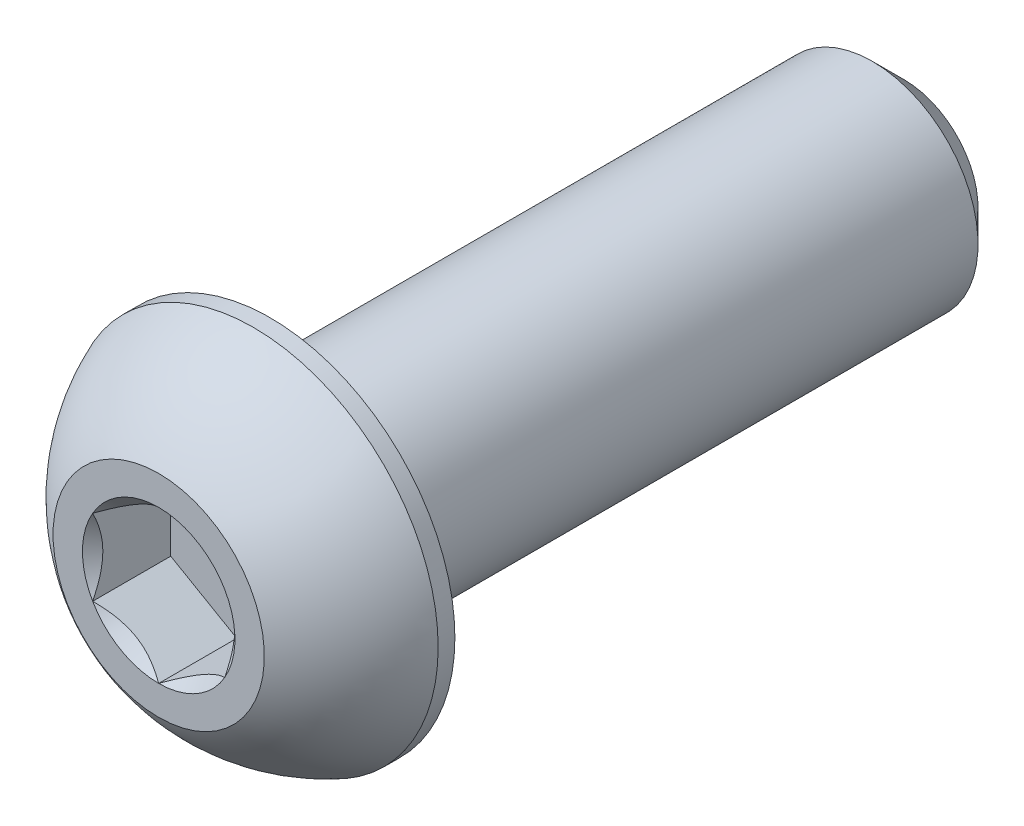
ISO-10303-21;
HEADER;
FILE_DESCRIPTION(('STEP AP214'),'2;1');
FILE_NAME('part.step','',(''),(''),'','','');
FILE_SCHEMA(('AUTOMOTIVE_DESIGN { 1 0 10303 214 1 1 1 1 }'));
ENDSEC;
DATA;
#1=APPLICATION_CONTEXT('core data for automotive mechanical design processes');
#2=APPLICATION_PROTOCOL_DEFINITION('international standard','automotive_design',2000,#1);
#3=PRODUCT_CONTEXT('',#1,'mechanical');
#4=PRODUCT('Part','Part','',(#3));
#5=PRODUCT_RELATED_PRODUCT_CATEGORY('part','',(#4));
#6=PRODUCT_DEFINITION_FORMATION('','',#4);
#7=PRODUCT_DEFINITION_CONTEXT('part definition',#1,'design');
#8=PRODUCT_DEFINITION('design','',#6,#7);
#9=PRODUCT_DEFINITION_SHAPE('','',#8);
#10=(LENGTH_UNIT() NAMED_UNIT(*) SI_UNIT(.MILLI.,.METRE.));
#11=(NAMED_UNIT(*) PLANE_ANGLE_UNIT() SI_UNIT($,.RADIAN.));
#12=(NAMED_UNIT(*) SI_UNIT($,.STERADIAN.) SOLID_ANGLE_UNIT());
#13=UNCERTAINTY_MEASURE_WITH_UNIT(LENGTH_MEASURE(1.E-05),#10,'distance_accuracy_value','');
#14=(GEOMETRIC_REPRESENTATION_CONTEXT(3) GLOBAL_UNCERTAINTY_ASSIGNED_CONTEXT((#13)) GLOBAL_UNIT_ASSIGNED_CONTEXT((#10,
#11,#12)) REPRESENTATION_CONTEXT('',''));
#15=CARTESIAN_POINT('',(0.,0.,0.));
#16=DIRECTION('',(0.,0.,1.));
#17=DIRECTION('',(1.,0.,0.));
#18=AXIS2_PLACEMENT_3D('',#15,#16,#17);
#19=CARTESIAN_POINT('',(0.,-3.175,-22.4028));
#20=DIRECTION('',(0.,0.,-1.));
#21=DIRECTION('',(0.,1.,0.));
#22=AXIS2_PLACEMENT_3D('',#19,#20,#21);
#23=PLANE('',#22);
#24=CARTESIAN_POINT('',(0.,0.,-22.4028));
#25=DIRECTION('',(0.,0.,-1.));
#26=DIRECTION('',(0.,1.,0.));
#27=AXIS2_PLACEMENT_3D('',#24,#25,#26);
#28=CIRCLE('',#27,2.22250000000001);
#29=CARTESIAN_POINT('',(0.,2.22250000000001,-22.4028));
#30=VERTEX_POINT('',#29);
#31=EDGE_CURVE('E176',#30,#30,#28,.T.);
#32=ORIENTED_EDGE('',*,*,#31,.T.);
#33=EDGE_LOOP('',(#32));
#34=FACE_BOUND('',#33,.T.);
#35=ADVANCED_FACE('F36',(#34),#23,.T.);
#36=CARTESIAN_POINT('',(0.,0.,-22.4028));
#37=DIRECTION('',(0.,0.,-1.));
#38=DIRECTION('',(0.,1.,0.));
#39=AXIS2_PLACEMENT_3D('',#36,#37,#38);
#40=CYLINDRICAL_SURFACE('',#39,3.175);
#41=CARTESIAN_POINT('',(0.,0.,-21.4503));
#42=DIRECTION('',(0.,0.,-1.));
#43=DIRECTION('',(0.,1.,0.));
#44=AXIS2_PLACEMENT_3D('',#41,#42,#43);
#45=CIRCLE('',#44,3.175);
#46=CARTESIAN_POINT('',(0.,3.175,-21.4503));
#47=VERTEX_POINT('',#46);
#48=EDGE_CURVE('E50',#47,#47,#45,.F.);
#49=ORIENTED_EDGE('',*,*,#48,.T.);
#50=EDGE_LOOP('',(#49));
#51=FACE_BOUND('',#50,.T.);
#52=CARTESIAN_POINT('',(0.,0.,-3.3528));
#53=DIRECTION('',(0.,0.,1.));
#54=DIRECTION('',(1.,0.,0.));
#55=AXIS2_PLACEMENT_3D('',#52,#53,#54);
#56=CIRCLE('',#55,3.175);
#57=CARTESIAN_POINT('',(3.175,0.,-3.3528));
#58=VERTEX_POINT('',#57);
#59=EDGE_CURVE('E173',#58,#58,#56,.F.);
#60=ORIENTED_EDGE('',*,*,#59,.T.);
#61=EDGE_LOOP('',(#60));
#62=FACE_BOUND('',#61,.T.);
#63=ADVANCED_FACE('F181',(#51,#62),#40,.T.);
#64=CARTESIAN_POINT('',(0.,0.,-22.4028));
#65=DIRECTION('',(0.,0.,1.));
#66=DIRECTION('',(0.,-1.,0.));
#67=AXIS2_PLACEMENT_3D('',#64,#65,#66);
#68=CONICAL_SURFACE('',#67,2.22250000000001,0.785398163397448);
#69=ORIENTED_EDGE('',*,*,#48,.F.);
#70=EDGE_LOOP('',(#69));
#71=FACE_BOUND('',#70,.T.);
#72=ORIENTED_EDGE('',*,*,#31,.F.);
#73=EDGE_LOOP('',(#72));
#74=FACE_BOUND('',#73,.T.);
#75=ADVANCED_FACE('F38',(#71,#74),#68,.T.);
#76=CARTESIAN_POINT('',(0.,0.,-5.060315));
#77=DIRECTION('',(0.,0.,1.));
#78=DIRECTION('',(0.,-1.,0.));
#79=AXIS2_PLACEMENT_3D('',#76,#77,#78);
#80=SPHERICAL_SURFACE('',#79,5.97389428256184);
#81=CARTESIAN_POINT('',(0.,0.,0.));
#82=DIRECTION('',(0.,0.,1.));
#83=DIRECTION('',(1.,0.,0.));
#84=AXIS2_PLACEMENT_3D('',#81,#82,#83);
#85=CIRCLE('',#84,3.175);
#86=CARTESIAN_POINT('',(0.,-3.175,0.));
#87=VERTEX_POINT('',#86);
#88=EDGE_CURVE('E170',#87,#87,#85,.T.);
#89=CARTESIAN_POINT('',(0.,0.,-2.84988));
#90=DIRECTION('',(0.,0.,1.));
#91=DIRECTION('',(1.,0.,0.));
#92=AXIS2_PLACEMENT_3D('',#89,#90,#91);
#93=CIRCLE('',#92,5.5499);
#94=CARTESIAN_POINT('',(0.,-5.5499,-2.84988));
#95=VERTEX_POINT('',#94);
#96=EDGE_CURVE('E164',#95,#95,#93,.T.);
#97=CARTESIAN_POINT('',(0.,-3.175,0.));
#98=CARTESIAN_POINT('',(0.,-3.20828343957184,-0.0208830076580502));
#99=CARTESIAN_POINT('',(0.,-3.24136078860705,-0.0420944789280503));
#100=CARTESIAN_POINT('',(0.,-3.30709055775141,-0.0851658910984718));
#101=CARTESIAN_POINT('',(0.,-3.33974297786056,-0.107025831998893));
#102=CARTESIAN_POINT('',(0.,-3.40461014130008,-0.151385725836676));
#103=CARTESIAN_POINT('',(0.,-3.43682488463043,-0.173885678774039));
#104=CARTESIAN_POINT('',(0.,-3.50080416139461,-0.219516822259479));
#105=CARTESIAN_POINT('',(0.,-3.53256869482844,-0.242648012807557));
#106=CARTESIAN_POINT('',(0.,-3.59563518208834,-0.289532629449102));
#107=CARTESIAN_POINT('',(0.,-3.62693713591442,-0.313286055542569));
#108=CARTESIAN_POINT('',(0.,-3.68906627753106,-0.36140589409133));
#109=CARTESIAN_POINT('',(0.,-3.71989346532163,-0.385772306546626));
#110=CARTESIAN_POINT('',(0.,-3.78106107243204,-0.435108631276877));
#111=CARTESIAN_POINT('',(0.,-3.8114014917519,-0.460078543551833));
#112=CARTESIAN_POINT('',(0.,-3.87158374923259,-0.510612146063938));
#113=CARTESIAN_POINT('',(0.,-3.90142558739343,-0.536175836301086));
#114=CARTESIAN_POINT('',(0.,-3.96059906392414,-0.587887041792083));
#115=CARTESIAN_POINT('',(0.,-3.989930702294,-0.614034557045931));
#116=CARTESIAN_POINT('',(0.,-4.04807235926832,-0.666903232293407));
#117=CARTESIAN_POINT('',(0.,-4.07688237787279,-0.693624392287034));
#118=CARTESIAN_POINT('',(0.,-4.13396957842491,-0.747629953401057));
#119=CARTESIAN_POINT('',(0.,-4.16224676037257,-0.774914354521453));
#120=CARTESIAN_POINT('',(0.,-4.21825727817542,-0.830035774981947));
#121=CARTESIAN_POINT('',(0.,-4.24599061403061,-0.857872794322045));
#122=CARTESIAN_POINT('',(0.,-4.30090264195357,-0.91408861315902));
#123=CARTESIAN_POINT('',(0.,-4.32808133402134,-0.942467412655899));
#124=CARTESIAN_POINT('',(0.,-4.38187349261953,-0.999755742806741));
#125=CARTESIAN_POINT('',(0.,-4.40848695914995,-1.0286652734607));
#126=CARTESIAN_POINT('',(0.,-4.46113830498838,-1.08700381029123));
#127=CARTESIAN_POINT('',(0.,-4.48717618429639,-1.11643281646778));
#128=CARTESIAN_POINT('',(0.,-4.53866621810402,-1.17579884645643));
#129=CARTESIAN_POINT('',(0.,-4.56411837260364,-1.20573587026853));
#130=CARTESIAN_POINT('',(0.,-4.61442704725457,-1.26610627984964));
#131=CARTESIAN_POINT('',(0.,-4.63928356740587,-1.29653966561866));
#132=CARTESIAN_POINT('',(0.,-4.68839129572448,-1.3578909501815));
#133=CARTESIAN_POINT('',(0.,-4.71264250389178,-1.38880884897531));
#134=CARTESIAN_POINT('',(0.,-4.76053016627881,-1.45111712201534));
#135=CARTESIAN_POINT('',(0.,-4.78416662049853,-1.48250749626155));
#136=CARTESIAN_POINT('',(0.,-4.8308155723751,-1.54574849868041));
#137=CARTESIAN_POINT('',(0.,-4.85382807003194,-1.57759912685306));
#138=CARTESIAN_POINT('',(0.,-4.89922014909859,-1.64174823640362));
#139=CARTESIAN_POINT('',(0.,-4.92159973050841,-1.67404671778154));
#140=CARTESIAN_POINT('',(0.,-4.96571726381658,-1.73907895865427));
#141=CARTESIAN_POINT('',(0.,-4.98745521571493,-1.77181271814908));
#142=CARTESIAN_POINT('',(0.,-5.03028102654719,-1.83770277069632));
#143=CARTESIAN_POINT('',(0.,-5.0513688854811,-1.87085906374874));
#144=CARTESIAN_POINT('',(0.,-5.09288630004063,-1.93758127434189));
#145=CARTESIAN_POINT('',(0.,-5.11331585566624,-1.97114719188261));
#146=CARTESIAN_POINT('',(0.,-5.15350870956168,-2.03867558290299));
#147=CARTESIAN_POINT('',(0.,-5.17327200783151,-2.07263805638265));
#148=CARTESIAN_POINT('',(0.,-5.21212465239608,-2.14094633632486));
#149=CARTESIAN_POINT('',(0.,-5.23121399869082,-2.17529214278741));
#150=CARTESIAN_POINT('',(0.,-5.26871130697935,-2.2443537165359));
#151=CARTESIAN_POINT('',(0.,-5.28711926897315,-2.27906948382184));
#152=CARTESIAN_POINT('',(0.,-5.32324664200827,-2.3488574628552));
#153=CARTESIAN_POINT('',(0.,-5.3409660530496,-2.38392967460262));
#154=CARTESIAN_POINT('',(0.,-5.37570942417474,-2.45441688802313));
#155=CARTESIAN_POINT('',(0.,-5.39273338425856,-2.48983188969622));
#156=CARTESIAN_POINT('',(0.,-5.42607922958184,-2.56099089271574));
#157=CARTESIAN_POINT('',(0.,-5.44240111482132,-2.59673489406217));
#158=CARTESIAN_POINT('',(0.,-5.47433643994316,-2.66853798649801));
#159=CARTESIAN_POINT('',(0.,-5.48994987982553,-2.70459707758742));
#160=CARTESIAN_POINT('',(0.,-5.52046229408188,-2.77701628549785));
#161=CARTESIAN_POINT('',(0.,-5.53536126845586,-2.81337640231887));
#162=CARTESIAN_POINT('',(0.,-5.5499,-2.84988));
#163=B_SPLINE_CURVE_WITH_KNOTS('',3,(#97,#98,#99,#100,#101,#102,#103,#104,#105,#106,#107,#108,
#109,#110,#111,#112,#113,#114,#115,#116,#117,#118,#119,#120,#121,#122,#123,#124,#125,#126,#127,
#128,#129,#130,#131,#132,#133,#134,#135,#136,#137,#138,#139,#140,#141,#142,#143,#144,#145,#146,
#147,#148,#149,#150,#151,#152,#153,#154,#155,#156,#157,#158,#159,#160,#161,#162),.UNSPECIFIED.,
.F.,.F.,(4,2,2,2,2,2,2,2,2,2,2,2,2,2,2,2,2,2,2,2,2,2,2,2,2,2,2,2,2,2,2,2,4),(0.,0.1178750807537,
0.235750161507399,0.353625242261099,0.471500323014798,0.589375403768498,0.707250484522198,
0.825125565275897,0.943000646029597,1.0608757267833,1.17875080753699,1.2966258882907,
1.41450096904439,1.53237604979809,1.65025113055179,1.76812621130549,1.88600129205919,
2.00387637281289,2.12175145356659,2.23962653432029,2.35750161507399,2.47537669582769,
2.59325177658139,2.71112685733509,2.82900193808879,2.94687701884249,3.06475209959619,
3.18262718034989,3.30050226110359,3.41837734185729,3.53625242261099,3.65412750336469,
3.77200258411839),.UNSPECIFIED.);
#164=EDGE_CURVE('BSEAM186',#87,#95,#163,.T.);
#165=ORIENTED_EDGE('',*,*,#88,.F.);
#166=ORIENTED_EDGE('',*,*,#96,.T.);
#167=ORIENTED_EDGE('',*,*,#164,.T.);
#168=ORIENTED_EDGE('',*,*,#164,.F.);
#169=EDGE_LOOP('',(#165,#167,#166,#168));
#170=FACE_BOUND('',#169,.T.);
#171=ADVANCED_FACE('F186',(#170),#80,.T.);
#172=CARTESIAN_POINT('',(0.,-3.175,0.));
#173=DIRECTION('',(0.,0.,-1.));
#174=DIRECTION('',(-1.,0.,0.));
#175=AXIS2_PLACEMENT_3D('',#172,#173,#174);
#176=PLANE('',#175);
#177=CARTESIAN_POINT('',(0.,0.,0.));
#178=DIRECTION('',(0.,0.,1.));
#179=DIRECTION('',(1.,0.,0.));
#180=AXIS2_PLACEMENT_3D('',#177,#178,#179);
#181=CIRCLE('',#180,2.29135888084633);
#182=CARTESIAN_POINT('',(-1.984375,1.14567944042316,0.));
#183=VERTEX_POINT('',#182);
#184=CARTESIAN_POINT('',(-1.984375,-1.14567944042316,0.));
#185=VERTEX_POINT('',#184);
#186=EDGE_CURVE('E63',#183,#185,#181,.T.);
#187=ORIENTED_EDGE('',*,*,#186,.F.);
#188=CARTESIAN_POINT('',(0.,2.29135888084633,0.));
#189=VERTEX_POINT('',#188);
#190=EDGE_CURVE('E135',#189,#183,#181,.T.);
#191=ORIENTED_EDGE('',*,*,#190,.F.);
#192=CARTESIAN_POINT('',(1.984375,1.14567944042316,0.));
#193=VERTEX_POINT('',#192);
#194=EDGE_CURVE('E132',#193,#189,#181,.T.);
#195=ORIENTED_EDGE('',*,*,#194,.F.);
#196=CARTESIAN_POINT('',(1.984375,-1.14567944042316,0.));
#197=VERTEX_POINT('',#196);
#198=EDGE_CURVE('E103',#197,#193,#181,.T.);
#199=ORIENTED_EDGE('',*,*,#198,.F.);
#200=CARTESIAN_POINT('',(0.,-2.29135888084633,0.));
#201=VERTEX_POINT('',#200);
#202=EDGE_CURVE('E95',#201,#197,#181,.T.);
#203=ORIENTED_EDGE('',*,*,#202,.F.);
#204=EDGE_CURVE('E56',#185,#201,#181,.T.);
#205=ORIENTED_EDGE('',*,*,#204,.F.);
#206=EDGE_LOOP('',(#187,#191,#195,#199,#203,#205));
#207=FACE_BOUND('',#206,.T.);
#208=ORIENTED_EDGE('',*,*,#88,.T.);
#209=EDGE_LOOP('',(#208));
#210=FACE_BOUND('',#209,.T.);
#211=ADVANCED_FACE('F129',(#207,#210),#176,.F.);
#212=CARTESIAN_POINT('',(0.,-5.5499,-3.3528));
#213=DIRECTION('',(0.,0.,1.));
#214=DIRECTION('',(1.,0.,0.));
#215=AXIS2_PLACEMENT_3D('',#212,#213,#214);
#216=PLANE('',#215);
#217=ORIENTED_EDGE('',*,*,#59,.F.);
#218=EDGE_LOOP('',(#217));
#219=FACE_BOUND('',#218,.T.);
#220=CARTESIAN_POINT('',(0.,0.,-3.3528));
#221=DIRECTION('',(0.,0.,1.));
#222=DIRECTION('',(1.,0.,0.));
#223=AXIS2_PLACEMENT_3D('',#220,#221,#222);
#224=CIRCLE('',#223,5.5499);
#225=CARTESIAN_POINT('',(5.5499,0.,-3.3528));
#226=VERTEX_POINT('',#225);
#227=EDGE_CURVE('E167',#226,#226,#224,.T.);
#228=ORIENTED_EDGE('',*,*,#227,.F.);
#229=EDGE_LOOP('',(#228));
#230=FACE_BOUND('',#229,.T.);
#231=ADVANCED_FACE('F200',(#219,#230),#216,.F.);
#232=CARTESIAN_POINT('',(0.,0.,0.));
#233=DIRECTION('',(0.,0.,1.));
#234=DIRECTION('',(1.,0.,0.));
#235=AXIS2_PLACEMENT_3D('',#232,#233,#234);
#236=CYLINDRICAL_SURFACE('',#235,5.5499);
#237=ORIENTED_EDGE('',*,*,#96,.F.);
#238=EDGE_LOOP('',(#237));
#239=FACE_BOUND('',#238,.T.);
#240=ORIENTED_EDGE('',*,*,#227,.T.);
#241=EDGE_LOOP('',(#240));
#242=FACE_BOUND('',#241,.T.);
#243=ADVANCED_FACE('F203',(#239,#242),#236,.T.);
#244=CARTESIAN_POINT('',(0.,0.,0.));
#245=DIRECTION('',(0.,0.,1.));
#246=DIRECTION('',(1.,0.,0.));
#247=AXIS2_PLACEMENT_3D('',#244,#245,#246);
#248=CONICAL_SURFACE('',#247,2.29135888084633,0.78539816339745);
#249=ORIENTED_EDGE('',*,*,#198,.T.);
#250=CARTESIAN_POINT('',(1.984375,-2.28495242157822,0.734984078816568));
#251=CARTESIAN_POINT('',(1.984375,-2.22931635455402,0.692986685550762));
#252=CARTESIAN_POINT('',(1.984375,-2.17336876548389,0.651396054076336));
#253=CARTESIAN_POINT('',(1.984375,-2.06072770258171,0.569208461471479));
#254=CARTESIAN_POINT('',(1.984375,-2.00403404503435,0.528611752405042));
#255=CARTESIAN_POINT('',(1.984375,-1.88936329173488,0.448303503174668));
#256=CARTESIAN_POINT('',(1.984375,-1.83137965519348,0.408601258813307));
#257=CARTESIAN_POINT('',(1.984375,-1.7144280213784,0.330685173401292));
#258=CARTESIAN_POINT('',(1.984375,-1.65546009407228,0.292471227194368));
#259=CARTESIAN_POINT('',(1.984375,-1.47005472306035,0.176252834013637));
#260=CARTESIAN_POINT('',(1.984375,-1.34163909427883,0.101347886872381));
#261=CARTESIAN_POINT('',(1.984375,-1.0784038470548,-0.0356697845602627));
#262=CARTESIAN_POINT('',(1.984375,-0.943607781407424,-0.0978256335176254));
#263=CARTESIAN_POINT('',(1.984375,-0.741275100444881,-0.173867421311381));
#264=CARTESIAN_POINT('',(1.984375,-0.676735408881095,-0.195691938673995));
#265=CARTESIAN_POINT('',(1.984375,-0.546098118112761,-0.234159536462205));
#266=CARTESIAN_POINT('',(1.984375,-0.480000411919955,-0.250802259934452));
#267=CARTESIAN_POINT('',(1.984375,-0.347746170028531,-0.277764619130277));
#268=CARTESIAN_POINT('',(1.984375,-0.281612071479122,-0.288192590264109));
#269=CARTESIAN_POINT('',(1.984375,-0.14863662005235,-0.302521852623404));
#270=CARTESIAN_POINT('',(1.984375,-0.0817953907393235,-0.306424265772614));
#271=CARTESIAN_POINT('',(1.984375,0.0495156750890644,-0.307412948667327));
#272=CARTESIAN_POINT('',(1.984375,0.113983775102991,-0.304740821124985));
#273=CARTESIAN_POINT('',(1.984375,0.242367515846177,-0.293260789502485));
#274=CARTESIAN_POINT('',(1.984375,0.30628310229592,-0.284452289360786));
#275=CARTESIAN_POINT('',(1.984375,0.434181040262184,-0.261030978667103));
#276=CARTESIAN_POINT('',(1.984375,0.498145026858309,-0.246319393767914));
#277=CARTESIAN_POINT('',(1.984375,0.624675616953007,-0.211873818587874));
#278=CARTESIAN_POINT('',(1.984375,0.687242336899689,-0.192140248550805));
#279=CARTESIAN_POINT('',(1.984375,0.884225483826088,-0.12258776276924));
#280=CARTESIAN_POINT('',(1.984375,1.01583674256468,-0.0648475887435034));
#281=CARTESIAN_POINT('',(1.984375,1.27288659242652,0.063530336588798));
#282=CARTESIAN_POINT('',(1.984375,1.3983008827048,0.134214424919413));
#283=CARTESIAN_POINT('',(1.984375,1.57956687990221,0.244516663813199));
#284=CARTESIAN_POINT('',(1.984375,1.63738271299424,0.280969829475364));
#285=CARTESIAN_POINT('',(1.984375,1.75202215386202,0.355415963291705));
#286=CARTESIAN_POINT('',(1.984375,1.80884568601362,0.393409048078054));
#287=CARTESIAN_POINT('',(1.984375,1.92116923084255,0.470338808893091));
#288=CARTESIAN_POINT('',(1.984375,1.97667624512253,0.509265313038791));
#289=CARTESIAN_POINT('',(1.984375,2.08693170717166,0.588147746121386));
#290=CARTESIAN_POINT('',(1.984375,2.14168035934793,0.62810338902403));
#291=CARTESIAN_POINT('',(1.984375,2.19611149046622,0.668480611285427));
#292=B_SPLINE_CURVE_WITH_KNOTS('',3,(#250,#251,#252,#253,#254,#255,#256,#257,#258,#259,#260,
#261,#262,#263,#264,#265,#266,#267,#268,#269,#270,#271,#272,#273,#274,#275,#276,#277,#278,#279,
#280,#281,#282,#283,#284,#285,#286,#287,#288,#289,#290,#291),.UNSPECIFIED.,.F.,.F.,(4,2,2,2,2,2,
2,2,2,2,2,2,2,2,2,2,2,2,2,2,4),(0.,0.209126070008322,0.418304637356569,0.629103979977992,
0.839888401371185,1.28549951116127,1.72957750768351,1.93379389749971,2.13802435186698,
2.33858179514334,2.53910475350639,2.73236963400794,2.92565329006887,3.12231577097487,
3.31896180041345,3.74886295245172,4.18033428125362,4.3853601718029,4.59040161996383,
4.79377749165108,4.99709743524131),.UNSPECIFIED.);
#293=EDGE_CURVE('E11',#197,#193,#292,.T.);
#294=ORIENTED_EDGE('',*,*,#293,.F.);
#295=EDGE_LOOP('',(#249,#294));
#296=FACE_BOUND('',#295,.T.);
#297=ADVANCED_FACE('F107',(#296),#248,.F.);
#298=ORIENTED_EDGE('',*,*,#194,.T.);
#299=CARTESIAN_POINT('',(1.984575,1.14556397036933,0.000115478781843379));
#300=CARTESIAN_POINT('',(1.9163590048332,1.18494849354192,-0.0392371477360855));
#301=CARTESIAN_POINT('',(1.84700231489303,1.22499159714897,-0.0762786895538155));
#302=CARTESIAN_POINT('',(1.70557619954781,1.30664400291398,-0.144101141576677));
#303=CARTESIAN_POINT('',(1.63349332126322,1.34826107209555,-0.174844310908246));
#304=CARTESIAN_POINT('',(1.488141602734,1.43217992591557,-0.227508111188786));
#305=CARTESIAN_POINT('',(1.41490978751306,1.47446033414663,-0.249561124120036));
#306=CARTESIAN_POINT('',(1.26683381740529,1.55995203534886,-0.283538507056124));
#307=CARTESIAN_POINT('',(1.19199418724658,1.60316071596705,-0.295488243908271));
#308=CARTESIAN_POINT('',(1.06301458545618,1.6776271237807,-0.306269900918094));
#309=CARTESIAN_POINT('',(1.00904128422756,1.7087886237741,-0.30786610094093));
#310=CARTESIAN_POINT('',(0.901182881480199,1.77106070163465,-0.305178161134708));
#311=CARTESIAN_POINT('',(0.847297817514476,1.80217125782056,-0.300891959659541));
#312=CARTESIAN_POINT('',(0.740036461751395,1.86409863044402,-0.286683126986481));
#313=CARTESIAN_POINT('',(0.686660807239859,1.89491507894443,-0.276754189547727));
#314=CARTESIAN_POINT('',(0.580832482591103,1.95601509066828,-0.251804915725461));
#315=CARTESIAN_POINT('',(0.528379742028898,1.9862986945516,-0.236784969610512));
#316=CARTESIAN_POINT('',(0.394017661036351,2.06387267818152,-0.19219214836433));
#317=CARTESIAN_POINT('',(0.312941642841675,2.11068193911104,-0.159257004061667));
#318=CARTESIAN_POINT('',(0.19372669327016,2.17951072233758,-0.103657558797803));
#319=CARTESIAN_POINT('',(0.154440075613998,2.20219286161692,-0.0841224079481375));
#320=CARTESIAN_POINT('',(0.0765946381319467,2.24713694590237,-0.0432712618805984));
#321=CARTESIAN_POINT('',(0.0380353888983008,2.26939913882716,-0.0219563604316496));
#322=CARTESIAN_POINT('',(-0.00020000000000058,2.29147435090017,0.000115478781842942));
#323=B_SPLINE_CURVE_WITH_KNOTS('',3,(#299,#300,#301,#302,#303,#304,#305,#306,#307,#308,#309,
#310,#311,#312,#313,#314,#315,#316,#317,#318,#319,#320,#321,#322),.UNSPECIFIED.,.F.,.F.,(4,2,2,
2,2,2,2,2,2,2,2,4),(0.,0.264339630306627,0.530219665093694,0.79187641637146,1.05287424418109,
1.239639843932,1.42647091743852,1.61351120244035,1.8005371524754,2.09764209964316,
2.24579179873714,2.39385111134157),.UNSPECIFIED.);
#324=EDGE_CURVE('E134',#193,#189,#323,.T.);
#325=ORIENTED_EDGE('',*,*,#324,.F.);
#326=EDGE_LOOP('',(#298,#325));
#327=FACE_BOUND('',#326,.T.);
#328=ADVANCED_FACE('F288',(#327),#248,.F.);
#329=ORIENTED_EDGE('',*,*,#190,.T.);
#330=CARTESIAN_POINT('',(0.000199999999999608,2.29147435090017,0.000115478781843248));
#331=CARTESIAN_POINT('',(-0.0680159951668025,2.25208982772757,-0.0392371477360854));
#332=CARTESIAN_POINT('',(-0.137372685106966,2.21204672412052,-0.0762786895538155));
#333=CARTESIAN_POINT('',(-0.278798800452188,2.13039431835551,-0.144101141576677));
#334=CARTESIAN_POINT('',(-0.350881678736783,2.08877724917394,-0.174844310908246));
#335=CARTESIAN_POINT('',(-0.496233397266004,2.00485839535392,-0.227508111188786));
#336=CARTESIAN_POINT('',(-0.569465212486939,1.96257798712287,-0.249561124120036));
#337=CARTESIAN_POINT('',(-0.717541182594707,1.87708628592063,-0.283538507056124));
#338=CARTESIAN_POINT('',(-0.792380812753425,1.83387760530244,-0.295488243908272));
#339=CARTESIAN_POINT('',(-0.921360414543816,1.75941119748879,-0.306269900918094));
#340=CARTESIAN_POINT('',(-0.975333715772443,1.72824969749539,-0.307866100940931));
#341=CARTESIAN_POINT('',(-1.0831921185198,1.66597761963484,-0.305178161134708));
#342=CARTESIAN_POINT('',(-1.13707718248552,1.63486706344893,-0.300891959659541));
#343=CARTESIAN_POINT('',(-1.2443385382486,1.57293969082547,-0.286683126986481));
#344=CARTESIAN_POINT('',(-1.29771419276014,1.54212324232506,-0.276754189547727));
#345=CARTESIAN_POINT('',(-1.4035425174089,1.48102323060122,-0.251804915725462));
#346=CARTESIAN_POINT('',(-1.4559952579711,1.45073962671789,-0.236784969610512));
#347=CARTESIAN_POINT('',(-1.59035733896365,1.37316564308797,-0.19219214836433));
#348=CARTESIAN_POINT('',(-1.67143335715832,1.32635638215845,-0.159257004061668));
#349=CARTESIAN_POINT('',(-1.79064830672984,1.25752759893191,-0.103657558797804));
#350=CARTESIAN_POINT('',(-1.829934924386,1.23484545965257,-0.0841224079481378));
#351=CARTESIAN_POINT('',(-1.90778036186805,1.18990137536712,-0.0432712618805986));
#352=CARTESIAN_POINT('',(-1.9463396111017,1.16763918244233,-0.0219563604316498));
#353=CARTESIAN_POINT('',(-1.984575,1.14556397036933,0.000115478781842511));
#354=B_SPLINE_CURVE_WITH_KNOTS('',3,(#330,#331,#332,#333,#334,#335,#336,#337,#338,#339,#340,
#341,#342,#343,#344,#345,#346,#347,#348,#349,#350,#351,#352,#353),.UNSPECIFIED.,.F.,.F.,(4,2,2,
2,2,2,2,2,2,2,2,4),(0.,0.264339630306627,0.530219665093694,0.791876416371461,1.05287424418109,
1.239639843932,1.42647091743852,1.61351120244035,1.8005371524754,2.09764209964316,
2.24579179873714,2.39385111134157),.UNSPECIFIED.);
#355=EDGE_CURVE('E139',#189,#183,#354,.T.);
#356=ORIENTED_EDGE('',*,*,#355,.F.);
#357=EDGE_LOOP('',(#329,#356));
#358=FACE_BOUND('',#357,.T.);
#359=ADVANCED_FACE('F142',(#358),#248,.F.);
#360=ORIENTED_EDGE('',*,*,#186,.T.);
#361=CARTESIAN_POINT('',(-1.984375,-2.28495242157823,0.734984078816569));
#362=CARTESIAN_POINT('',(-1.984375,-2.22931635455402,0.692986685550762));
#363=CARTESIAN_POINT('',(-1.984375,-2.17336876548389,0.651396054076336));
#364=CARTESIAN_POINT('',(-1.984375,-2.06072770258171,0.56920846147148));
#365=CARTESIAN_POINT('',(-1.984375,-2.00403404503435,0.528611752405043));
#366=CARTESIAN_POINT('',(-1.984375,-1.88936329173489,0.448303503174669));
#367=CARTESIAN_POINT('',(-1.984375,-1.83137965519348,0.408601258813308));
#368=CARTESIAN_POINT('',(-1.984375,-1.7144280213784,0.330685173401292));
#369=CARTESIAN_POINT('',(-1.984375,-1.65546009407228,0.292471227194368));
#370=CARTESIAN_POINT('',(-1.984375,-1.47005472306035,0.176252834013636));
#371=CARTESIAN_POINT('',(-1.984375,-1.34163909427883,0.101347886872382));
#372=CARTESIAN_POINT('',(-1.984375,-1.0784038470548,-0.0356697845602624));
#373=CARTESIAN_POINT('',(-1.984375,-0.943607781407425,-0.0978256335176256));
#374=CARTESIAN_POINT('',(-1.984375,-0.741275100444882,-0.173867421311381));
#375=CARTESIAN_POINT('',(-1.984375,-0.676735408881095,-0.195691938673995));
#376=CARTESIAN_POINT('',(-1.984375,-0.546098118112762,-0.234159536462205));
#377=CARTESIAN_POINT('',(-1.984375,-0.480000411919956,-0.250802259934452));
#378=CARTESIAN_POINT('',(-1.984375,-0.347746170028532,-0.277764619130277));
#379=CARTESIAN_POINT('',(-1.984375,-0.281612071479123,-0.288192590264108));
#380=CARTESIAN_POINT('',(-1.984375,-0.14863662005235,-0.302521852623404));
#381=CARTESIAN_POINT('',(-1.984375,-0.0817953907393237,-0.306424265772614));
#382=CARTESIAN_POINT('',(-1.984375,0.0495156750890643,-0.307412948667328));
#383=CARTESIAN_POINT('',(-1.984375,0.113983775102991,-0.304740821124985));
#384=CARTESIAN_POINT('',(-1.984375,0.242367515846177,-0.293260789502485));
#385=CARTESIAN_POINT('',(-1.984375,0.306283102295919,-0.284452289360786));
#386=CARTESIAN_POINT('',(-1.984375,0.434181040262184,-0.261030978667103));
#387=CARTESIAN_POINT('',(-1.984375,0.498145026858309,-0.246319393767914));
#388=CARTESIAN_POINT('',(-1.984375,0.624675616953007,-0.211873818587874));
#389=CARTESIAN_POINT('',(-1.984375,0.687242336899689,-0.192140248550805));
#390=CARTESIAN_POINT('',(-1.984375,0.884225483826087,-0.12258776276924));
#391=CARTESIAN_POINT('',(-1.984375,1.01583674256468,-0.0648475887435036));
#392=CARTESIAN_POINT('',(-1.984375,1.27288659242652,0.0635303365887976));
#393=CARTESIAN_POINT('',(-1.984375,1.3983008827048,0.134214424919412));
#394=CARTESIAN_POINT('',(-1.984375,1.57956687990221,0.244516663813198));
#395=CARTESIAN_POINT('',(-1.984375,1.63738271299424,0.280969829475363));
#396=CARTESIAN_POINT('',(-1.984375,1.75202215386202,0.355415963291704));
#397=CARTESIAN_POINT('',(-1.984375,1.80884568601362,0.393409048078054));
#398=CARTESIAN_POINT('',(-1.984375,1.92116923084255,0.47033880889309));
#399=CARTESIAN_POINT('',(-1.984375,1.97667624512253,0.509265313038791));
#400=CARTESIAN_POINT('',(-1.984375,2.08693170717166,0.588147746121386));
#401=CARTESIAN_POINT('',(-1.984375,2.14168035934793,0.628103389024029));
#402=CARTESIAN_POINT('',(-1.984375,2.19611149046622,0.668480611285426));
#403=B_SPLINE_CURVE_WITH_KNOTS('',3,(#361,#362,#363,#364,#365,#366,#367,#368,#369,#370,#371,
#372,#373,#374,#375,#376,#377,#378,#379,#380,#381,#382,#383,#384,#385,#386,#387,#388,#389,#390,
#391,#392,#393,#394,#395,#396,#397,#398,#399,#400,#401,#402),.UNSPECIFIED.,.F.,.F.,(4,2,2,2,2,2,
2,2,2,2,2,2,2,2,2,2,2,2,2,2,4),(0.,0.209126070008322,0.41830463735657,0.629103979977993,
0.839888401371186,1.28549951116127,1.72957750768351,1.93379389749972,2.13802435186698,
2.33858179514334,2.53910475350639,2.73236963400794,2.92565329006887,3.12231577097488,
3.31896180041345,3.74886295245172,4.18033428125362,4.3853601718029,4.59040161996383,
4.79377749165108,4.99709743524131),.UNSPECIFIED.);
#404=EDGE_CURVE('E146',#183,#185,#403,.F.);
#405=ORIENTED_EDGE('',*,*,#404,.F.);
#406=EDGE_LOOP('',(#360,#405));
#407=FACE_BOUND('',#406,.T.);
#408=ADVANCED_FACE('F282',(#407),#248,.F.);
#409=ORIENTED_EDGE('',*,*,#204,.T.);
#410=CARTESIAN_POINT('',(-1.984575,-1.14556397036933,0.000115478781843379));
#411=CARTESIAN_POINT('',(-1.9163590048332,-1.18494849354192,-0.0392371477360847));
#412=CARTESIAN_POINT('',(-1.84700231489303,-1.22499159714897,-0.0762786895538149));
#413=CARTESIAN_POINT('',(-1.70557619954781,-1.30664400291398,-0.144101141576677));
#414=CARTESIAN_POINT('',(-1.63349332126322,-1.34826107209555,-0.174844310908247));
#415=CARTESIAN_POINT('',(-1.488141602734,-1.43217992591557,-0.227508111188786));
#416=CARTESIAN_POINT('',(-1.41490978751306,-1.47446033414663,-0.249561124120036));
#417=CARTESIAN_POINT('',(-1.26683381740529,-1.55995203534886,-0.283538507056124));
#418=CARTESIAN_POINT('',(-1.19199418724658,-1.60316071596705,-0.295488243908271));
#419=CARTESIAN_POINT('',(-1.06301458545618,-1.6776271237807,-0.306269900918094));
#420=CARTESIAN_POINT('',(-1.00904128422756,-1.7087886237741,-0.30786610094093));
#421=CARTESIAN_POINT('',(-0.9011828814802,-1.77106070163465,-0.305178161134707));
#422=CARTESIAN_POINT('',(-0.847297817514477,-1.80217125782056,-0.30089195965954));
#423=CARTESIAN_POINT('',(-0.740036461751396,-1.86409863044402,-0.286683126986481));
#424=CARTESIAN_POINT('',(-0.68666080723986,-1.89491507894443,-0.276754189547727));
#425=CARTESIAN_POINT('',(-0.580832482591103,-1.95601509066828,-0.251804915725461));
#426=CARTESIAN_POINT('',(-0.528379742028898,-1.9862986945516,-0.236784969610511));
#427=CARTESIAN_POINT('',(-0.394017661036351,-2.06387267818152,-0.19219214836433));
#428=CARTESIAN_POINT('',(-0.312941642841675,-2.11068193911104,-0.159257004061667));
#429=CARTESIAN_POINT('',(-0.19372669327016,-2.17951072233758,-0.103657558797803));
#430=CARTESIAN_POINT('',(-0.154440075613998,-2.20219286161692,-0.0841224079481371));
#431=CARTESIAN_POINT('',(-0.0765946381319465,-2.24713694590237,-0.0432712618805977));
#432=CARTESIAN_POINT('',(-0.0380353888983009,-2.26939913882716,-0.0219563604316487));
#433=CARTESIAN_POINT('',(0.000200000000000425,-2.29147435090017,0.000115478781843735));
#434=B_SPLINE_CURVE_WITH_KNOTS('',3,(#410,#411,#412,#413,#414,#415,#416,#417,#418,#419,#420,
#421,#422,#423,#424,#425,#426,#427,#428,#429,#430,#431,#432,#433),.UNSPECIFIED.,.F.,.F.,(4,2,2,
2,2,2,2,2,2,2,2,4),(0.,0.264339630306627,0.530219665093694,0.79187641637146,1.05287424418109,
1.239639843932,1.42647091743852,1.61351120244035,1.8005371524754,2.09764209964316,
2.24579179873714,2.39385111134157),.UNSPECIFIED.);
#435=EDGE_CURVE('E119',#185,#201,#434,.T.);
#436=ORIENTED_EDGE('',*,*,#435,.F.);
#437=EDGE_LOOP('',(#409,#436));
#438=FACE_BOUND('',#437,.T.);
#439=ADVANCED_FACE('F230',(#438),#248,.F.);
#440=ORIENTED_EDGE('',*,*,#202,.T.);
#441=CARTESIAN_POINT('',(-0.000199999999999594,-2.29147435090017,0.000115478781843681));
#442=CARTESIAN_POINT('',(0.0680159951668032,-2.25208982772757,-0.0392371477360843));
#443=CARTESIAN_POINT('',(0.137372685106967,-2.21204672412052,-0.0762786895538144));
#444=CARTESIAN_POINT('',(0.278798800452188,-2.13039431835551,-0.144101141576676));
#445=CARTESIAN_POINT('',(0.350881678736783,-2.08877724917394,-0.174844310908246));
#446=CARTESIAN_POINT('',(0.496233397266004,-2.00485839535392,-0.227508111188787));
#447=CARTESIAN_POINT('',(0.569465212486939,-1.96257798712287,-0.249561124120036));
#448=CARTESIAN_POINT('',(0.717541182594707,-1.87708628592063,-0.283538507056124));
#449=CARTESIAN_POINT('',(0.792380812753425,-1.83387760530244,-0.295488243908272));
#450=CARTESIAN_POINT('',(0.921360414543816,-1.75941119748879,-0.306269900918094));
#451=CARTESIAN_POINT('',(0.975333715772443,-1.72824969749539,-0.30786610094093));
#452=CARTESIAN_POINT('',(1.0831921185198,-1.66597761963484,-0.305178161134708));
#453=CARTESIAN_POINT('',(1.13707718248552,-1.63486706344893,-0.300891959659541));
#454=CARTESIAN_POINT('',(1.2443385382486,-1.57293969082547,-0.286683126986481));
#455=CARTESIAN_POINT('',(1.29771419276014,-1.54212324232506,-0.276754189547727));
#456=CARTESIAN_POINT('',(1.4035425174089,-1.48102323060122,-0.251804915725462));
#457=CARTESIAN_POINT('',(1.4559952579711,-1.45073962671789,-0.236784969610512));
#458=CARTESIAN_POINT('',(1.59035733896365,-1.37316564308797,-0.19219214836433));
#459=CARTESIAN_POINT('',(1.67143335715832,-1.32635638215845,-0.159257004061668));
#460=CARTESIAN_POINT('',(1.79064830672984,-1.25752759893191,-0.103657558797804));
#461=CARTESIAN_POINT('',(1.829934924386,-1.23484545965257,-0.0841224079481379));
#462=CARTESIAN_POINT('',(1.90778036186805,-1.18990137536712,-0.0432712618805987));
#463=CARTESIAN_POINT('',(1.9463396111017,-1.16763918244233,-0.0219563604316498));
#464=CARTESIAN_POINT('',(1.984575,-1.14556397036933,0.000115478781842673));
#465=B_SPLINE_CURVE_WITH_KNOTS('',3,(#441,#442,#443,#444,#445,#446,#447,#448,#449,#450,#451,
#452,#453,#454,#455,#456,#457,#458,#459,#460,#461,#462,#463,#464),.UNSPECIFIED.,.F.,.F.,(4,2,2,
2,2,2,2,2,2,2,2,4),(0.,0.264339630306627,0.530219665093695,0.791876416371461,1.05287424418109,
1.239639843932,1.42647091743852,1.61351120244035,1.8005371524754,2.09764209964316,
2.24579179873714,2.39385111134157),.UNSPECIFIED.);
#466=EDGE_CURVE('E99',#201,#197,#465,.T.);
#467=ORIENTED_EDGE('',*,*,#466,.F.);
#468=EDGE_LOOP('',(#440,#467));
#469=FACE_BOUND('',#468,.T.);
#470=ADVANCED_FACE('F97',(#469),#248,.F.);
#471=CARTESIAN_POINT('',(1.984375,-1.14567944042316,-2.34696));
#472=DIRECTION('',(0.,0.,1.));
#473=DIRECTION('',(1.,0.,0.));
#474=AXIS2_PLACEMENT_3D('',#471,#472,#473);
#475=PLANE('',#474);
#476=DIRECTION('',(0.866025403784438,0.5,0.));
#477=VECTOR('',#476,1.);
#478=CARTESIAN_POINT('',(0.,-2.29135888084633,-2.34696));
#479=LINE('',#478,#477);
#480=CARTESIAN_POINT('',(0.,-2.29135888084633,-2.34696));
#481=VERTEX_POINT('',#480);
#482=CARTESIAN_POINT('',(1.984375,-1.14567944042316,-2.34696));
#483=VERTEX_POINT('',#482);
#484=EDGE_CURVE('E118',#481,#483,#479,.T.);
#485=ORIENTED_EDGE('',*,*,#484,.T.);
#486=DIRECTION('',(0.,1.,0.));
#487=VECTOR('',#486,1.);
#488=CARTESIAN_POINT('',(1.984375,-1.14567944042316,-2.34696));
#489=LINE('',#488,#487);
#490=CARTESIAN_POINT('',(1.984375,1.14567944042316,-2.34696));
#491=VERTEX_POINT('',#490);
#492=EDGE_CURVE('E123',#483,#491,#489,.T.);
#493=ORIENTED_EDGE('',*,*,#492,.T.);
#494=DIRECTION('',(-0.866025403784439,0.5,0.));
#495=VECTOR('',#494,1.);
#496=CARTESIAN_POINT('',(1.984375,1.14567944042316,-2.34696));
#497=LINE('',#496,#495);
#498=CARTESIAN_POINT('',(0.,2.29135888084633,-2.34696));
#499=VERTEX_POINT('',#498);
#500=EDGE_CURVE('E272',#491,#499,#497,.T.);
#501=ORIENTED_EDGE('',*,*,#500,.T.);
#502=DIRECTION('',(-0.866025403784438,-0.5,0.));
#503=VECTOR('',#502,1.);
#504=CARTESIAN_POINT('',(0.,2.29135888084633,-2.34696));
#505=LINE('',#504,#503);
#506=CARTESIAN_POINT('',(-1.984375,1.14567944042316,-2.34696));
#507=VERTEX_POINT('',#506);
#508=EDGE_CURVE('E155',#499,#507,#505,.T.);
#509=ORIENTED_EDGE('',*,*,#508,.T.);
#510=DIRECTION('',(0.,-1.,0.));
#511=VECTOR('',#510,1.);
#512=CARTESIAN_POINT('',(-1.984375,1.14567944042316,-2.34696));
#513=LINE('',#512,#511);
#514=CARTESIAN_POINT('',(-1.984375,-1.14567944042316,-2.34696));
#515=VERTEX_POINT('',#514);
#516=EDGE_CURVE('E276',#507,#515,#513,.T.);
#517=ORIENTED_EDGE('',*,*,#516,.T.);
#518=DIRECTION('',(0.866025403784439,-0.5,0.));
#519=VECTOR('',#518,1.);
#520=CARTESIAN_POINT('',(-1.984375,-1.14567944042316,-2.34696));
#521=LINE('',#520,#519);
#522=EDGE_CURVE('E126',#515,#481,#521,.T.);
#523=ORIENTED_EDGE('',*,*,#522,.T.);
#524=EDGE_LOOP('',(#485,#493,#501,#509,#517,#523));
#525=FACE_BOUND('',#524,.T.);
#526=ADVANCED_FACE('F229',(#525),#475,.T.);
#527=CARTESIAN_POINT('',(1.984375,-1.14567944042316,-2.34696));
#528=DIRECTION('',(1.,0.,0.));
#529=DIRECTION('',(0.,0.,-1.));
#530=AXIS2_PLACEMENT_3D('',#527,#528,#529);
#531=PLANE('',#530);
#532=DIRECTION('',(0.,0.,1.));
#533=VECTOR('',#532,1.);
#534=CARTESIAN_POINT('',(1.984375,-1.14567944042316,-2.34696));
#535=LINE('',#534,#533);
#536=EDGE_CURVE('E115',#483,#197,#535,.T.);
#537=ORIENTED_EDGE('',*,*,#536,.T.);
#538=ORIENTED_EDGE('',*,*,#293,.T.);
#539=DIRECTION('',(0.,0.,1.));
#540=VECTOR('',#539,1.);
#541=CARTESIAN_POINT('',(1.984375,1.14567944042316,-2.34696));
#542=LINE('',#541,#540);
#543=EDGE_CURVE('E125',#491,#193,#542,.T.);
#544=ORIENTED_EDGE('',*,*,#543,.F.);
#545=ORIENTED_EDGE('',*,*,#492,.F.);
#546=EDGE_LOOP('',(#537,#538,#544,#545));
#547=FACE_BOUND('',#546,.T.);
#548=ADVANCED_FACE('F121',(#547),#531,.F.);
#549=CARTESIAN_POINT('',(1.984375,1.14567944042316,-2.34696));
#550=DIRECTION('',(0.5,0.866025403784439,0.));
#551=DIRECTION('',(-0.866025403784439,0.5,0.));
#552=AXIS2_PLACEMENT_3D('',#549,#550,#551);
#553=PLANE('',#552);
#554=ORIENTED_EDGE('',*,*,#543,.T.);
#555=ORIENTED_EDGE('',*,*,#324,.T.);
#556=DIRECTION('',(0.,0.,1.));
#557=VECTOR('',#556,1.);
#558=CARTESIAN_POINT('',(0.,2.29135888084633,-2.34696));
#559=LINE('',#558,#557);
#560=EDGE_CURVE('E151',#499,#189,#559,.T.);
#561=ORIENTED_EDGE('',*,*,#560,.F.);
#562=ORIENTED_EDGE('',*,*,#500,.F.);
#563=EDGE_LOOP('',(#554,#555,#561,#562));
#564=FACE_BOUND('',#563,.T.);
#565=ADVANCED_FACE('F149',(#564),#553,.F.);
#566=CARTESIAN_POINT('',(0.,2.29135888084633,-2.34696));
#567=DIRECTION('',(-0.5,0.866025403784438,0.));
#568=DIRECTION('',(-0.866025403784438,-0.5,0.));
#569=AXIS2_PLACEMENT_3D('',#566,#567,#568);
#570=PLANE('',#569);
#571=ORIENTED_EDGE('',*,*,#560,.T.);
#572=ORIENTED_EDGE('',*,*,#355,.T.);
#573=DIRECTION('',(0.,0.,1.));
#574=VECTOR('',#573,1.);
#575=CARTESIAN_POINT('',(-1.984375,1.14567944042316,-2.34696));
#576=LINE('',#575,#574);
#577=EDGE_CURVE('E157',#507,#183,#576,.T.);
#578=ORIENTED_EDGE('',*,*,#577,.F.);
#579=ORIENTED_EDGE('',*,*,#508,.F.);
#580=EDGE_LOOP('',(#571,#572,#578,#579));
#581=FACE_BOUND('',#580,.T.);
#582=ADVANCED_FACE('F153',(#581),#570,.F.);
#583=CARTESIAN_POINT('',(-1.984375,1.14567944042316,-2.34696));
#584=DIRECTION('',(-1.,0.,0.));
#585=DIRECTION('',(0.,0.,1.));
#586=AXIS2_PLACEMENT_3D('',#583,#584,#585);
#587=PLANE('',#586);
#588=ORIENTED_EDGE('',*,*,#577,.T.);
#589=ORIENTED_EDGE('',*,*,#404,.T.);
#590=DIRECTION('',(0.,0.,1.));
#591=VECTOR('',#590,1.);
#592=CARTESIAN_POINT('',(-1.984375,-1.14567944042316,-2.34696));
#593=LINE('',#592,#591);
#594=EDGE_CURVE('E159',#515,#185,#593,.T.);
#595=ORIENTED_EDGE('',*,*,#594,.F.);
#596=ORIENTED_EDGE('',*,*,#516,.F.);
#597=EDGE_LOOP('',(#588,#589,#595,#596));
#598=FACE_BOUND('',#597,.T.);
#599=ADVANCED_FACE('F251',(#598),#587,.F.);
#600=CARTESIAN_POINT('',(-1.984375,-1.14567944042316,-2.34696));
#601=DIRECTION('',(-0.5,-0.866025403784439,0.));
#602=DIRECTION('',(0.866025403784439,-0.5,0.));
#603=AXIS2_PLACEMENT_3D('',#600,#601,#602);
#604=PLANE('',#603);
#605=ORIENTED_EDGE('',*,*,#594,.T.);
#606=ORIENTED_EDGE('',*,*,#435,.T.);
#607=DIRECTION('',(0.,0.,1.));
#608=VECTOR('',#607,1.);
#609=CARTESIAN_POINT('',(0.,-2.29135888084633,-2.34696));
#610=LINE('',#609,#608);
#611=EDGE_CURVE('E117',#481,#201,#610,.T.);
#612=ORIENTED_EDGE('',*,*,#611,.F.);
#613=ORIENTED_EDGE('',*,*,#522,.F.);
#614=EDGE_LOOP('',(#605,#606,#612,#613));
#615=FACE_BOUND('',#614,.T.);
#616=ADVANCED_FACE('F210',(#615),#604,.F.);
#617=CARTESIAN_POINT('',(0.,-2.29135888084633,-2.34696));
#618=DIRECTION('',(0.5,-0.866025403784438,0.));
#619=DIRECTION('',(0.866025403784438,0.5,0.));
#620=AXIS2_PLACEMENT_3D('',#617,#618,#619);
#621=PLANE('',#620);
#622=ORIENTED_EDGE('',*,*,#611,.T.);
#623=ORIENTED_EDGE('',*,*,#466,.T.);
#624=ORIENTED_EDGE('',*,*,#536,.F.);
#625=ORIENTED_EDGE('',*,*,#484,.F.);
#626=EDGE_LOOP('',(#622,#623,#624,#625));
#627=FACE_BOUND('',#626,.T.);
#628=ADVANCED_FACE('F113',(#627),#621,.F.);
#629=CLOSED_SHELL('',(#35,#63,#75,#171,#211,#231,#243,#297,#328,#359,#408,#439,#470,#526,#548,
#565,#582,#599,#616,#628));
#630=MANIFOLD_SOLID_BREP('B2',#629);
#631=ADVANCED_BREP_SHAPE_REPRESENTATION('',(#18,#630),#14);
#632=SHAPE_DEFINITION_REPRESENTATION(#9,#631);
ENDSEC;
END-ISO-10303-21;
